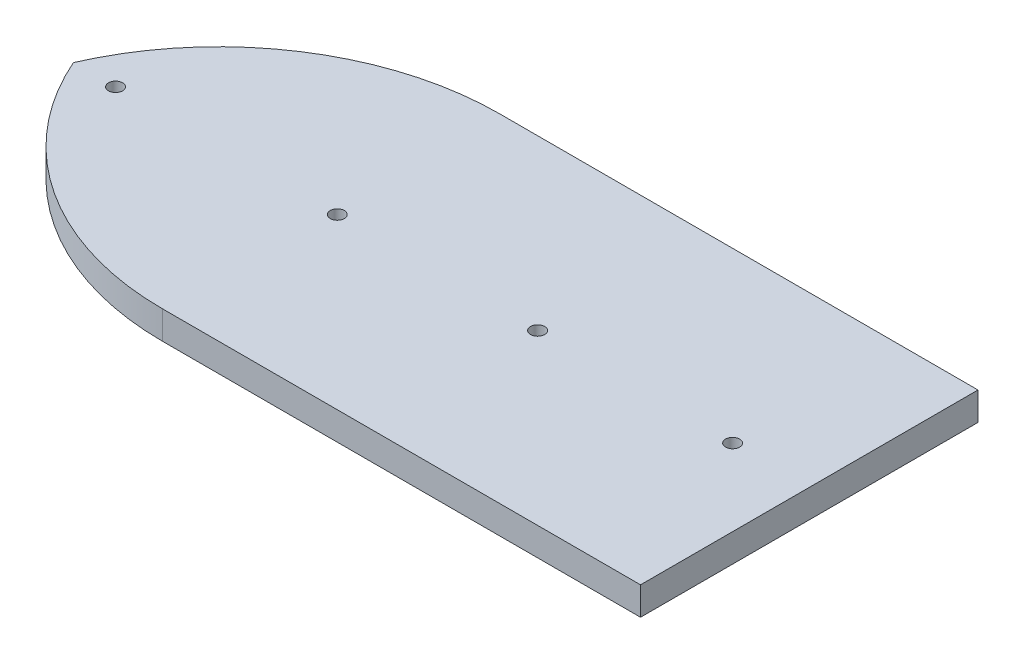
ISO-10303-21;
HEADER;
FILE_DESCRIPTION(('STEP AP214'),'2;1');
FILE_NAME('part.step','',(''),(''),'','','');
FILE_SCHEMA(('AUTOMOTIVE_DESIGN { 1 0 10303 214 1 1 1 1 }'));
ENDSEC;
DATA;
#1=APPLICATION_CONTEXT('core data for automotive mechanical design processes');
#2=APPLICATION_PROTOCOL_DEFINITION('international standard','automotive_design',2000,#1);
#3=PRODUCT_CONTEXT('',#1,'mechanical');
#4=PRODUCT('Part','Part','',(#3));
#5=PRODUCT_RELATED_PRODUCT_CATEGORY('part','',(#4));
#6=PRODUCT_DEFINITION_FORMATION('','',#4);
#7=PRODUCT_DEFINITION_CONTEXT('part definition',#1,'design');
#8=PRODUCT_DEFINITION('design','',#6,#7);
#9=PRODUCT_DEFINITION_SHAPE('','',#8);
#10=(LENGTH_UNIT() NAMED_UNIT(*) SI_UNIT(.MILLI.,.METRE.));
#11=(NAMED_UNIT(*) PLANE_ANGLE_UNIT() SI_UNIT($,.RADIAN.));
#12=(NAMED_UNIT(*) SI_UNIT($,.STERADIAN.) SOLID_ANGLE_UNIT());
#13=UNCERTAINTY_MEASURE_WITH_UNIT(LENGTH_MEASURE(1.E-05),#10,'distance_accuracy_value','');
#14=(GEOMETRIC_REPRESENTATION_CONTEXT(3) GLOBAL_UNCERTAINTY_ASSIGNED_CONTEXT((#13)) GLOBAL_UNIT_ASSIGNED_CONTEXT((#10,
#11,#12)) REPRESENTATION_CONTEXT('',''));
#15=CARTESIAN_POINT('',(0.,0.,0.));
#16=DIRECTION('',(0.,0.,1.));
#17=DIRECTION('',(1.,0.,0.));
#18=AXIS2_PLACEMENT_3D('',#15,#16,#17);
#19=CARTESIAN_POINT('',(-0.124411731264706,-3162.60636648086,29.8485700556631));
#20=DIRECTION('',(0.,1.,0.));
#21=DIRECTION('',(0.,0.,1.));
#22=AXIS2_PLACEMENT_3D('',#19,#20,#21);
#23=PLANE('',#22);
#24=CARTESIAN_POINT('',(14.5532755069481,-3162.60636648086,21.8462060187169));
#25=DIRECTION('',(0.,1.,0.));
#26=DIRECTION('',(0.,0.,1.));
#27=AXIS2_PLACEMENT_3D('',#24,#25,#26);
#28=CIRCLE('',#27,0.501124617992182);
#29=CARTESIAN_POINT('',(14.5532755069481,-3162.60636648086,22.347330636709));
#30=VERTEX_POINT('',#29);
#31=EDGE_CURVE('E139',#30,#30,#28,.T.);
#32=ORIENTED_EDGE('',*,*,#31,.F.);
#33=EDGE_LOOP('',(#32));
#34=FACE_BOUND('',#33,.T.);
#35=CARTESIAN_POINT('',(-15.4643170841849,-3162.60636648086,21.8462060187169));
#36=DIRECTION('',(0.,1.,0.));
#37=DIRECTION('',(0.,0.,1.));
#38=AXIS2_PLACEMENT_3D('',#35,#36,#37);
#39=CIRCLE('',#38,0.499999999999999);
#40=CARTESIAN_POINT('',(-15.4643170841849,-3162.60636648086,22.3462060187169));
#41=VERTEX_POINT('',#40);
#42=EDGE_CURVE('E112',#41,#41,#39,.T.);
#43=ORIENTED_EDGE('',*,*,#42,.F.);
#44=EDGE_LOOP('',(#43));
#45=FACE_BOUND('',#44,.T.);
#46=DIRECTION('',(1.,0.,0.));
#47=VECTOR('',#46,1.);
#48=CARTESIAN_POINT('',(-0.12441173126465,-3162.60636648086,33.8485700556631));
#49=LINE('',#48,#47);
#50=CARTESIAN_POINT('',(-0.124411731264984,-3162.60636648086,33.8485700556631));
#51=VERTEX_POINT('',#50);
#52=CARTESIAN_POINT('',(33.8755882687354,-3162.60636648086,33.8485700556625));
#53=VERTEX_POINT('',#52);
#54=EDGE_CURVE('E83',#51,#53,#49,.T.);
#55=ORIENTED_EDGE('',*,*,#54,.T.);
#56=DIRECTION('',(0.,0.,-1.));
#57=VECTOR('',#56,1.);
#58=CARTESIAN_POINT('',(33.8755882687354,-3162.60636648086,33.8485700556625));
#59=LINE('',#58,#57);
#60=CARTESIAN_POINT('',(33.875588268735,-3162.60636648086,9.84857005566306));
#61=VERTEX_POINT('',#60);
#62=EDGE_CURVE('E94',#53,#61,#59,.T.);
#63=ORIENTED_EDGE('',*,*,#62,.T.);
#64=DIRECTION('',(-1.,0.,-2.74086309204335E-13));
#65=VECTOR('',#64,1.);
#66=CARTESIAN_POINT('',(31.8755882687349,-3162.60636648086,9.84857005566251));
#67=LINE('',#66,#65);
#68=CARTESIAN_POINT('',(-0.12441173126506,-3162.60636648086,9.84857005566307));
#69=VERTEX_POINT('',#68);
#70=EDGE_CURVE('E88',#61,#69,#67,.T.);
#71=ORIENTED_EDGE('',*,*,#70,.T.);
#72=CARTESIAN_POINT('',(-0.124411731264706,-3162.60636648086,29.8485700556631));
#73=DIRECTION('',(0.,1.,0.));
#74=DIRECTION('',(0.,0.,1.));
#75=AXIS2_PLACEMENT_3D('',#72,#73,#74);
#76=CIRCLE('',#75,20.);
#77=CARTESIAN_POINT('',(-18.4547145110882,-3162.60636648086,21.8485700556634));
#78=VERTEX_POINT('',#77);
#79=EDGE_CURVE('E92',#69,#78,#76,.T.);
#80=ORIENTED_EDGE('',*,*,#79,.T.);
#81=CARTESIAN_POINT('',(-0.124411731264984,-3162.60636648086,13.8485700556631));
#82=DIRECTION('',(0.,1.,0.));
#83=DIRECTION('',(0.,0.,1.));
#84=AXIS2_PLACEMENT_3D('',#81,#82,#83);
#85=CIRCLE('',#84,20.);
#86=EDGE_CURVE('E50',#78,#51,#85,.T.);
#87=ORIENTED_EDGE('',*,*,#86,.T.);
#88=EDGE_LOOP('',(#55,#63,#71,#80,#87));
#89=FACE_BOUND('',#88,.T.);
#90=CARTESIAN_POINT('',(28.4198959863033,-3162.60636648086,21.8462060187169));
#91=DIRECTION('',(0.,1.,0.));
#92=DIRECTION('',(0.,0.,1.));
#93=AXIS2_PLACEMENT_3D('',#90,#91,#92);
#94=CIRCLE('',#93,0.499999999999999);
#95=CARTESIAN_POINT('',(28.4198959863033,-3162.60636648086,22.3462060187169));
#96=VERTEX_POINT('',#95);
#97=EDGE_CURVE('E133',#96,#96,#94,.T.);
#98=ORIENTED_EDGE('',*,*,#97,.F.);
#99=EDGE_LOOP('',(#98));
#100=FACE_BOUND('',#99,.T.);
#101=CARTESIAN_POINT('',(0.2875268861098,-3162.60636648086,21.8256535970749));
#102=DIRECTION('',(0.,1.,0.));
#103=DIRECTION('',(0.,0.,1.));
#104=AXIS2_PLACEMENT_3D('',#101,#102,#103);
#105=CIRCLE('',#104,0.5);
#106=CARTESIAN_POINT('',(0.2875268861098,-3162.60636648086,22.3256535970749));
#107=VERTEX_POINT('',#106);
#108=EDGE_CURVE('E145',#107,#107,#105,.T.);
#109=ORIENTED_EDGE('',*,*,#108,.F.);
#110=EDGE_LOOP('',(#109));
#111=FACE_BOUND('',#110,.T.);
#112=ADVANCED_FACE('F33',(#34,#45,#89,#100,#111),#23,.T.);
#113=CARTESIAN_POINT('',(-0.124411731264706,-3164.60636648086,29.8485700556631));
#114=DIRECTION('',(0.,1.,0.));
#115=DIRECTION('',(0.,0.,1.));
#116=AXIS2_PLACEMENT_3D('',#113,#114,#115);
#117=PLANE('',#116);
#118=DIRECTION('',(1.,0.,0.));
#119=VECTOR('',#118,1.);
#120=CARTESIAN_POINT('',(31.8755882687354,-3164.60636648086,33.8485700556625));
#121=LINE('',#120,#119);
#122=CARTESIAN_POINT('',(-0.124411731264984,-3164.60636648086,33.8485700556631));
#123=VERTEX_POINT('',#122);
#124=CARTESIAN_POINT('',(33.8755882687354,-3164.60636648086,33.8485700556625));
#125=VERTEX_POINT('',#124);
#126=EDGE_CURVE('E77',#123,#125,#121,.T.);
#127=ORIENTED_EDGE('',*,*,#126,.F.);
#128=CARTESIAN_POINT('',(-0.124411731264984,-3164.60636648086,13.8485700556631));
#129=DIRECTION('',(0.,1.,0.));
#130=DIRECTION('',(0.,0.,1.));
#131=AXIS2_PLACEMENT_3D('',#128,#129,#130);
#132=CIRCLE('',#131,20.);
#133=CARTESIAN_POINT('',(-18.4547145110882,-3164.60636648086,21.8485700556634));
#134=VERTEX_POINT('',#133);
#135=EDGE_CURVE('E117',#134,#123,#132,.T.);
#136=ORIENTED_EDGE('',*,*,#135,.F.);
#137=CARTESIAN_POINT('',(-0.124411731264706,-3164.60636648086,29.8485700556631));
#138=DIRECTION('',(0.,1.,0.));
#139=DIRECTION('',(0.,0.,1.));
#140=AXIS2_PLACEMENT_3D('',#137,#138,#139);
#141=CIRCLE('',#140,20.);
#142=CARTESIAN_POINT('',(-0.12441173126506,-3164.60636648086,9.84857005566307));
#143=VERTEX_POINT('',#142);
#144=EDGE_CURVE('E70',#143,#134,#141,.T.);
#145=ORIENTED_EDGE('',*,*,#144,.F.);
#146=DIRECTION('',(-1.,0.,0.));
#147=VECTOR('',#146,1.);
#148=CARTESIAN_POINT('',(31.8755882687349,-3164.60636648086,9.84857005566251));
#149=LINE('',#148,#147);
#150=CARTESIAN_POINT('',(33.875588268735,-3164.60636648086,9.84857005566306));
#151=VERTEX_POINT('',#150);
#152=EDGE_CURVE('E101',#151,#143,#149,.T.);
#153=ORIENTED_EDGE('',*,*,#152,.F.);
#154=DIRECTION('',(0.,0.,-1.));
#155=VECTOR('',#154,1.);
#156=CARTESIAN_POINT('',(33.8755882687354,-3164.60636648086,33.8485700556625));
#157=LINE('',#156,#155);
#158=EDGE_CURVE('E111',#125,#151,#157,.T.);
#159=ORIENTED_EDGE('',*,*,#158,.F.);
#160=EDGE_LOOP('',(#127,#136,#145,#153,#159));
#161=FACE_BOUND('',#160,.T.);
#162=CARTESIAN_POINT('',(-15.4643170841849,-3164.60636648086,21.8462060187169));
#163=DIRECTION('',(0.,1.,0.));
#164=DIRECTION('',(0.,0.,1.));
#165=AXIS2_PLACEMENT_3D('',#162,#163,#164);
#166=CIRCLE('',#165,0.499999999999999);
#167=CARTESIAN_POINT('',(-15.4643170841849,-3164.60636648086,22.3462060187169));
#168=VERTEX_POINT('',#167);
#169=EDGE_CURVE('E130',#168,#168,#166,.T.);
#170=ORIENTED_EDGE('',*,*,#169,.T.);
#171=EDGE_LOOP('',(#170));
#172=FACE_BOUND('',#171,.T.);
#173=CARTESIAN_POINT('',(28.4198959863033,-3164.60636648086,21.8462060187169));
#174=DIRECTION('',(0.,1.,0.));
#175=DIRECTION('',(0.,0.,1.));
#176=AXIS2_PLACEMENT_3D('',#173,#174,#175);
#177=CIRCLE('',#176,0.499999999999999);
#178=CARTESIAN_POINT('',(28.4198959863033,-3164.60636648086,22.3462060187169));
#179=VERTEX_POINT('',#178);
#180=EDGE_CURVE('E136',#179,#179,#177,.T.);
#181=ORIENTED_EDGE('',*,*,#180,.T.);
#182=EDGE_LOOP('',(#181));
#183=FACE_BOUND('',#182,.T.);
#184=CARTESIAN_POINT('',(14.5532755069481,-3164.60636648086,21.8462060187169));
#185=DIRECTION('',(0.,1.,0.));
#186=DIRECTION('',(0.,0.,1.));
#187=AXIS2_PLACEMENT_3D('',#184,#185,#186);
#188=CIRCLE('',#187,0.501124617992182);
#189=CARTESIAN_POINT('',(14.5532755069481,-3164.60636648086,22.347330636709));
#190=VERTEX_POINT('',#189);
#191=EDGE_CURVE('E142',#190,#190,#188,.T.);
#192=ORIENTED_EDGE('',*,*,#191,.T.);
#193=EDGE_LOOP('',(#192));
#194=FACE_BOUND('',#193,.T.);
#195=CARTESIAN_POINT('',(0.2875268861098,-3164.60636648086,21.8256535970749));
#196=DIRECTION('',(0.,1.,0.));
#197=DIRECTION('',(0.,0.,1.));
#198=AXIS2_PLACEMENT_3D('',#195,#196,#197);
#199=CIRCLE('',#198,0.5);
#200=CARTESIAN_POINT('',(0.2875268861098,-3164.60636648086,22.3256535970749));
#201=VERTEX_POINT('',#200);
#202=EDGE_CURVE('E148',#201,#201,#199,.T.);
#203=ORIENTED_EDGE('',*,*,#202,.T.);
#204=EDGE_LOOP('',(#203));
#205=FACE_BOUND('',#204,.T.);
#206=ADVANCED_FACE('F123',(#161,#172,#183,#194,#205),#117,.F.);
#207=CARTESIAN_POINT('',(31.8755882687354,-3162.60636648086,33.8485700556625));
#208=DIRECTION('',(0.,0.,-1.));
#209=DIRECTION('',(-1.,0.,0.));
#210=AXIS2_PLACEMENT_3D('',#207,#208,#209);
#211=PLANE('',#210);
#212=ORIENTED_EDGE('',*,*,#126,.T.);
#213=DIRECTION('',(0.,-1.,0.));
#214=VECTOR('',#213,1.);
#215=CARTESIAN_POINT('',(33.8755882687354,-3162.60636648086,33.8485700556625));
#216=LINE('',#215,#214);
#217=EDGE_CURVE('E11',#53,#125,#216,.T.);
#218=ORIENTED_EDGE('',*,*,#217,.F.);
#219=ORIENTED_EDGE('',*,*,#54,.F.);
#220=DIRECTION('',(0.,-1.,0.));
#221=VECTOR('',#220,1.);
#222=CARTESIAN_POINT('',(-0.124411731264984,-3162.60636648086,33.8485700556631));
#223=LINE('',#222,#221);
#224=EDGE_CURVE('E106',#51,#123,#223,.T.);
#225=ORIENTED_EDGE('',*,*,#224,.T.);
#226=EDGE_LOOP('',(#212,#218,#219,#225));
#227=FACE_BOUND('',#226,.T.);
#228=ADVANCED_FACE('F35',(#227),#211,.F.);
#229=CARTESIAN_POINT('',(33.8755882687354,-3162.60636648086,33.8485700556625));
#230=DIRECTION('',(-1.,0.,0.));
#231=DIRECTION('',(0.,0.,1.));
#232=AXIS2_PLACEMENT_3D('',#229,#230,#231);
#233=PLANE('',#232);
#234=ORIENTED_EDGE('',*,*,#158,.T.);
#235=DIRECTION('',(0.,-1.,0.));
#236=VECTOR('',#235,1.);
#237=CARTESIAN_POINT('',(33.875588268735,-3162.60636648086,9.84857005566306));
#238=LINE('',#237,#236);
#239=EDGE_CURVE('E42',#61,#151,#238,.T.);
#240=ORIENTED_EDGE('',*,*,#239,.F.);
#241=ORIENTED_EDGE('',*,*,#62,.F.);
#242=ORIENTED_EDGE('',*,*,#217,.T.);
#243=EDGE_LOOP('',(#234,#240,#241,#242));
#244=FACE_BOUND('',#243,.T.);
#245=ADVANCED_FACE('F122',(#244),#233,.F.);
#246=CARTESIAN_POINT('',(31.8755882687349,-3162.60636648086,9.84857005566251));
#247=DIRECTION('',(0.,0.,1.));
#248=DIRECTION('',(1.,0.,0.));
#249=AXIS2_PLACEMENT_3D('',#246,#247,#248);
#250=PLANE('',#249);
#251=ORIENTED_EDGE('',*,*,#152,.T.);
#252=DIRECTION('',(0.,-1.,0.));
#253=VECTOR('',#252,1.);
#254=CARTESIAN_POINT('',(-0.12441173126506,-3162.60636648086,9.84857005566307));
#255=LINE('',#254,#253);
#256=EDGE_CURVE('E99',#69,#143,#255,.T.);
#257=ORIENTED_EDGE('',*,*,#256,.F.);
#258=ORIENTED_EDGE('',*,*,#70,.F.);
#259=ORIENTED_EDGE('',*,*,#239,.T.);
#260=EDGE_LOOP('',(#251,#257,#258,#259));
#261=FACE_BOUND('',#260,.T.);
#262=ADVANCED_FACE('F100',(#261),#250,.F.);
#263=CARTESIAN_POINT('',(-0.124411731264706,-3162.60636648086,29.8485700556631));
#264=DIRECTION('',(0.,-1.,0.));
#265=DIRECTION('',(0.,0.,-1.));
#266=AXIS2_PLACEMENT_3D('',#263,#264,#265);
#267=CYLINDRICAL_SURFACE('',#266,20.);
#268=ORIENTED_EDGE('',*,*,#144,.T.);
#269=DIRECTION('',(0.,-1.,0.));
#270=VECTOR('',#269,1.);
#271=CARTESIAN_POINT('',(-18.4547145110882,-3162.60636648086,21.8485700556634));
#272=LINE('',#271,#270);
#273=EDGE_CURVE('E102',#78,#134,#272,.T.);
#274=ORIENTED_EDGE('',*,*,#273,.F.);
#275=ORIENTED_EDGE('',*,*,#79,.F.);
#276=ORIENTED_EDGE('',*,*,#256,.T.);
#277=EDGE_LOOP('',(#268,#274,#275,#276));
#278=FACE_BOUND('',#277,.T.);
#279=ADVANCED_FACE('F104',(#278),#267,.T.);
#280=CARTESIAN_POINT('',(-0.124411731264984,-3162.60636648086,13.8485700556631));
#281=DIRECTION('',(0.,-1.,0.));
#282=DIRECTION('',(0.,0.,-1.));
#283=AXIS2_PLACEMENT_3D('',#280,#281,#282);
#284=CYLINDRICAL_SURFACE('',#283,20.);
#285=ORIENTED_EDGE('',*,*,#135,.T.);
#286=ORIENTED_EDGE('',*,*,#224,.F.);
#287=ORIENTED_EDGE('',*,*,#86,.F.);
#288=ORIENTED_EDGE('',*,*,#273,.T.);
#289=EDGE_LOOP('',(#285,#286,#287,#288));
#290=FACE_BOUND('',#289,.T.);
#291=ADVANCED_FACE('F126',(#290),#284,.T.);
#292=CARTESIAN_POINT('',(-15.4643170841849,-3162.60636648086,21.8462060187169));
#293=DIRECTION('',(0.,-1.,0.));
#294=DIRECTION('',(0.,0.,-1.));
#295=AXIS2_PLACEMENT_3D('',#292,#293,#294);
#296=CYLINDRICAL_SURFACE('',#295,0.499999999999999);
#297=ORIENTED_EDGE('',*,*,#42,.T.);
#298=EDGE_LOOP('',(#297));
#299=FACE_BOUND('',#298,.T.);
#300=ORIENTED_EDGE('',*,*,#169,.F.);
#301=EDGE_LOOP('',(#300));
#302=FACE_BOUND('',#301,.T.);
#303=ADVANCED_FACE('F167',(#299,#302),#296,.F.);
#304=CARTESIAN_POINT('',(28.4198959863033,-3162.60636648086,21.8462060187169));
#305=DIRECTION('',(0.,-1.,0.));
#306=DIRECTION('',(0.,0.,-1.));
#307=AXIS2_PLACEMENT_3D('',#304,#305,#306);
#308=CYLINDRICAL_SURFACE('',#307,0.499999999999999);
#309=ORIENTED_EDGE('',*,*,#97,.T.);
#310=EDGE_LOOP('',(#309));
#311=FACE_BOUND('',#310,.T.);
#312=ORIENTED_EDGE('',*,*,#180,.F.);
#313=EDGE_LOOP('',(#312));
#314=FACE_BOUND('',#313,.T.);
#315=ADVANCED_FACE('F226',(#311,#314),#308,.F.);
#316=CARTESIAN_POINT('',(14.5532755069481,-3162.60636648086,21.8462060187169));
#317=DIRECTION('',(0.,-1.,0.));
#318=DIRECTION('',(0.,0.,-1.));
#319=AXIS2_PLACEMENT_3D('',#316,#317,#318);
#320=CYLINDRICAL_SURFACE('',#319,0.501124617992182);
#321=ORIENTED_EDGE('',*,*,#31,.T.);
#322=EDGE_LOOP('',(#321));
#323=FACE_BOUND('',#322,.T.);
#324=ORIENTED_EDGE('',*,*,#191,.F.);
#325=EDGE_LOOP('',(#324));
#326=FACE_BOUND('',#325,.T.);
#327=ADVANCED_FACE('F234',(#323,#326),#320,.F.);
#328=CARTESIAN_POINT('',(0.2875268861098,-3162.60636648086,21.8256535970749));
#329=DIRECTION('',(0.,-1.,0.));
#330=DIRECTION('',(0.,0.,-1.));
#331=AXIS2_PLACEMENT_3D('',#328,#329,#330);
#332=CYLINDRICAL_SURFACE('',#331,0.5);
#333=ORIENTED_EDGE('',*,*,#108,.T.);
#334=EDGE_LOOP('',(#333));
#335=FACE_BOUND('',#334,.T.);
#336=ORIENTED_EDGE('',*,*,#202,.F.);
#337=EDGE_LOOP('',(#336));
#338=FACE_BOUND('',#337,.T.);
#339=ADVANCED_FACE('F154',(#335,#338),#332,.F.);
#340=CLOSED_SHELL('',(#112,#206,#228,#245,#262,#279,#291,#303,#315,#327,#339));
#341=MANIFOLD_SOLID_BREP('B2',#340);
#342=ADVANCED_BREP_SHAPE_REPRESENTATION('',(#18,#341),#14);
#343=SHAPE_DEFINITION_REPRESENTATION(#9,#342);
ENDSEC;
END-ISO-10303-21;
